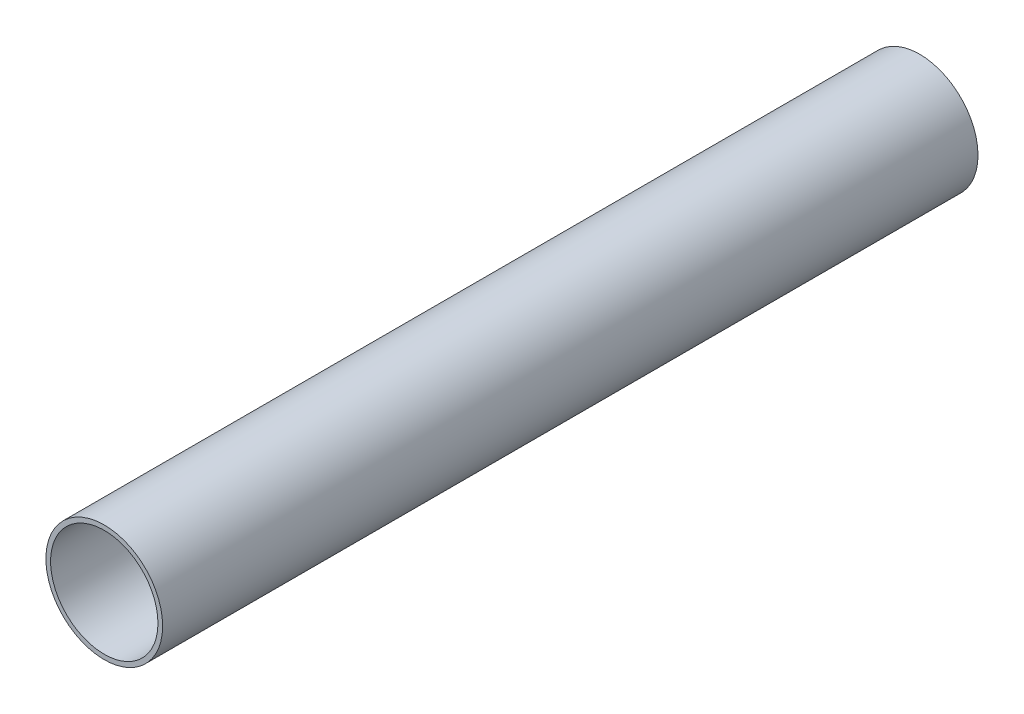
ISO-10303-21;
HEADER;
FILE_DESCRIPTION(('STEP AP214'),'2;1');
FILE_NAME('part.step','',(''),(''),'','','');
FILE_SCHEMA(('AUTOMOTIVE_DESIGN { 1 0 10303 214 1 1 1 1 }'));
ENDSEC;
DATA;
#1=APPLICATION_CONTEXT('core data for automotive mechanical design processes');
#2=APPLICATION_PROTOCOL_DEFINITION('international standard','automotive_design',2000,#1);
#3=PRODUCT_CONTEXT('',#1,'mechanical');
#4=PRODUCT('Part','Part','',(#3));
#5=PRODUCT_RELATED_PRODUCT_CATEGORY('part','',(#4));
#6=PRODUCT_DEFINITION_FORMATION('','',#4);
#7=PRODUCT_DEFINITION_CONTEXT('part definition',#1,'design');
#8=PRODUCT_DEFINITION('design','',#6,#7);
#9=PRODUCT_DEFINITION_SHAPE('','',#8);
#10=(LENGTH_UNIT() NAMED_UNIT(*) SI_UNIT(.MILLI.,.METRE.));
#11=(NAMED_UNIT(*) PLANE_ANGLE_UNIT() SI_UNIT($,.RADIAN.));
#12=(NAMED_UNIT(*) SI_UNIT($,.STERADIAN.) SOLID_ANGLE_UNIT());
#13=UNCERTAINTY_MEASURE_WITH_UNIT(LENGTH_MEASURE(1.E-05),#10,'distance_accuracy_value','');
#14=(GEOMETRIC_REPRESENTATION_CONTEXT(3) GLOBAL_UNCERTAINTY_ASSIGNED_CONTEXT((#13)) GLOBAL_UNIT_ASSIGNED_CONTEXT((#10,
#11,#12)) REPRESENTATION_CONTEXT('',''));
#15=CARTESIAN_POINT('',(0.,0.,0.));
#16=DIRECTION('',(0.,0.,1.));
#17=DIRECTION('',(1.,0.,0.));
#18=AXIS2_PLACEMENT_3D('',#15,#16,#17);
#19=CARTESIAN_POINT('',(0.,0.,349.25));
#20=DIRECTION('',(0.,0.,1.));
#21=DIRECTION('',(1.,0.,0.));
#22=AXIS2_PLACEMENT_3D('',#19,#20,#21);
#23=PLANE('',#22);
#24=CARTESIAN_POINT('',(0.,0.,349.25));
#25=DIRECTION('',(0.,0.,1.));
#26=DIRECTION('',(1.,0.,0.));
#27=AXIS2_PLACEMENT_3D('',#24,#25,#26);
#28=CIRCLE('',#27,25.);
#29=CARTESIAN_POINT('',(25.,0.,349.25));
#30=VERTEX_POINT('',#29);
#31=EDGE_CURVE('E10',#30,#30,#28,.T.);
#32=ORIENTED_EDGE('',*,*,#31,.T.);
#33=EDGE_LOOP('',(#32));
#34=FACE_BOUND('',#33,.T.);
#35=CARTESIAN_POINT('',(0.,0.,349.25));
#36=DIRECTION('',(0.,0.,1.));
#37=DIRECTION('',(1.,0.,0.));
#38=AXIS2_PLACEMENT_3D('',#35,#36,#37);
#39=CIRCLE('',#38,23.);
#40=CARTESIAN_POINT('',(23.,0.,349.25));
#41=VERTEX_POINT('',#40);
#42=EDGE_CURVE('E49',#41,#41,#39,.T.);
#43=ORIENTED_EDGE('',*,*,#42,.F.);
#44=EDGE_LOOP('',(#43));
#45=FACE_BOUND('',#44,.T.);
#46=ADVANCED_FACE('F38',(#34,#45),#23,.T.);
#47=CARTESIAN_POINT('',(0.,0.,0.));
#48=DIRECTION('',(0.,0.,1.));
#49=DIRECTION('',(1.,0.,0.));
#50=AXIS2_PLACEMENT_3D('',#47,#48,#49);
#51=PLANE('',#50);
#52=CARTESIAN_POINT('',(0.,0.,0.));
#53=DIRECTION('',(0.,0.,1.));
#54=DIRECTION('',(1.,0.,0.));
#55=AXIS2_PLACEMENT_3D('',#52,#53,#54);
#56=CIRCLE('',#55,25.);
#57=CARTESIAN_POINT('',(25.,0.,0.));
#58=VERTEX_POINT('',#57);
#59=EDGE_CURVE('E42',#58,#58,#56,.T.);
#60=ORIENTED_EDGE('',*,*,#59,.F.);
#61=EDGE_LOOP('',(#60));
#62=FACE_BOUND('',#61,.T.);
#63=CARTESIAN_POINT('',(0.,0.,0.));
#64=DIRECTION('',(0.,0.,1.));
#65=DIRECTION('',(1.,0.,0.));
#66=AXIS2_PLACEMENT_3D('',#63,#64,#65);
#67=CIRCLE('',#66,23.);
#68=CARTESIAN_POINT('',(23.,0.,0.));
#69=VERTEX_POINT('',#68);
#70=EDGE_CURVE('E51',#69,#69,#67,.T.);
#71=ORIENTED_EDGE('',*,*,#70,.T.);
#72=EDGE_LOOP('',(#71));
#73=FACE_BOUND('',#72,.T.);
#74=ADVANCED_FACE('F61',(#62,#73),#51,.F.);
#75=CARTESIAN_POINT('',(0.,0.,349.25));
#76=DIRECTION('',(0.,0.,-1.));
#77=DIRECTION('',(-1.,0.,0.));
#78=AXIS2_PLACEMENT_3D('',#75,#76,#77);
#79=CYLINDRICAL_SURFACE('',#78,25.);
#80=ORIENTED_EDGE('',*,*,#31,.F.);
#81=EDGE_LOOP('',(#80));
#82=FACE_BOUND('',#81,.T.);
#83=ORIENTED_EDGE('',*,*,#59,.T.);
#84=EDGE_LOOP('',(#83));
#85=FACE_BOUND('',#84,.T.);
#86=ADVANCED_FACE('F40',(#82,#85),#79,.T.);
#87=CARTESIAN_POINT('',(0.,0.,349.25));
#88=DIRECTION('',(0.,0.,-1.));
#89=DIRECTION('',(-1.,0.,0.));
#90=AXIS2_PLACEMENT_3D('',#87,#88,#89);
#91=CYLINDRICAL_SURFACE('',#90,23.);
#92=ORIENTED_EDGE('',*,*,#42,.T.);
#93=EDGE_LOOP('',(#92));
#94=FACE_BOUND('',#93,.T.);
#95=ORIENTED_EDGE('',*,*,#70,.F.);
#96=EDGE_LOOP('',(#95));
#97=FACE_BOUND('',#96,.T.);
#98=ADVANCED_FACE('F57',(#94,#97),#91,.F.);
#99=CLOSED_SHELL('',(#46,#74,#86,#98));
#100=MANIFOLD_SOLID_BREP('B2',#99);
#101=ADVANCED_BREP_SHAPE_REPRESENTATION('',(#18,#100),#14);
#102=SHAPE_DEFINITION_REPRESENTATION(#9,#101);
ENDSEC;
END-ISO-10303-21;
